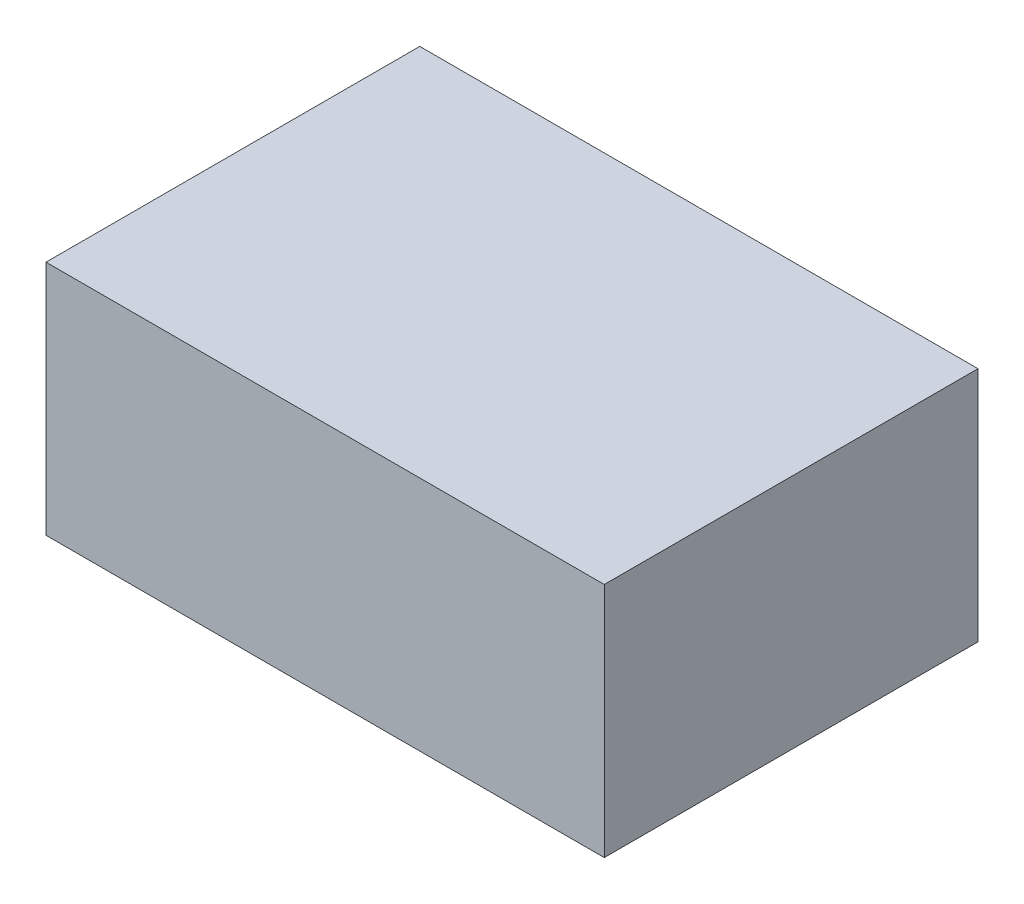
ISO-10303-21;
HEADER;
FILE_DESCRIPTION(('STEP AP214'),'2;1');
FILE_NAME('part.step','',(''),(''),'','','');
FILE_SCHEMA(('AUTOMOTIVE_DESIGN { 1 0 10303 214 1 1 1 1 }'));
ENDSEC;
DATA;
#1=APPLICATION_CONTEXT('core data for automotive mechanical design processes');
#2=APPLICATION_PROTOCOL_DEFINITION('international standard','automotive_design',2000,#1);
#3=PRODUCT_CONTEXT('',#1,'mechanical');
#4=PRODUCT('Part','Part','',(#3));
#5=PRODUCT_RELATED_PRODUCT_CATEGORY('part','',(#4));
#6=PRODUCT_DEFINITION_FORMATION('','',#4);
#7=PRODUCT_DEFINITION_CONTEXT('part definition',#1,'design');
#8=PRODUCT_DEFINITION('design','',#6,#7);
#9=PRODUCT_DEFINITION_SHAPE('','',#8);
#10=(LENGTH_UNIT() NAMED_UNIT(*) SI_UNIT(.MILLI.,.METRE.));
#11=(NAMED_UNIT(*) PLANE_ANGLE_UNIT() SI_UNIT($,.RADIAN.));
#12=(NAMED_UNIT(*) SI_UNIT($,.STERADIAN.) SOLID_ANGLE_UNIT());
#13=UNCERTAINTY_MEASURE_WITH_UNIT(LENGTH_MEASURE(1.E-05),#10,'distance_accuracy_value','');
#14=(GEOMETRIC_REPRESENTATION_CONTEXT(3) GLOBAL_UNCERTAINTY_ASSIGNED_CONTEXT((#13)) GLOBAL_UNIT_ASSIGNED_CONTEXT((#10,
#11,#12)) REPRESENTATION_CONTEXT('',''));
#15=CARTESIAN_POINT('',(0.,0.,0.));
#16=DIRECTION('',(0.,0.,1.));
#17=DIRECTION('',(1.,0.,0.));
#18=AXIS2_PLACEMENT_3D('',#15,#16,#17);
#19=CARTESIAN_POINT('',(1.4986,1.27,1.0033));
#20=DIRECTION('',(-1.,0.,0.));
#21=DIRECTION('',(0.,0.,1.));
#22=AXIS2_PLACEMENT_3D('',#19,#20,#21);
#23=PLANE('',#22);
#24=DIRECTION('',(0.,0.,-1.));
#25=VECTOR('',#24,1.);
#26=CARTESIAN_POINT('',(1.4986,0.,1.0033));
#27=LINE('',#26,#25);
#28=CARTESIAN_POINT('',(1.4986,0.,1.0033));
#29=VERTEX_POINT('',#28);
#30=CARTESIAN_POINT('',(1.4986,0.,-1.0033));
#31=VERTEX_POINT('',#30);
#32=EDGE_CURVE('E100',#29,#31,#27,.T.);
#33=ORIENTED_EDGE('',*,*,#32,.T.);
#34=DIRECTION('',(0.,-1.,0.));
#35=VECTOR('',#34,1.);
#36=CARTESIAN_POINT('',(1.4986,1.27,-1.0033));
#37=LINE('',#36,#35);
#38=CARTESIAN_POINT('',(1.4986,1.27,-1.0033));
#39=VERTEX_POINT('',#38);
#40=EDGE_CURVE('E11',#39,#31,#37,.T.);
#41=ORIENTED_EDGE('',*,*,#40,.F.);
#42=DIRECTION('',(0.,0.,-1.));
#43=VECTOR('',#42,1.);
#44=CARTESIAN_POINT('',(1.4986,1.27,1.0033));
#45=LINE('',#44,#43);
#46=CARTESIAN_POINT('',(1.4986,1.27,1.0033));
#47=VERTEX_POINT('',#46);
#48=EDGE_CURVE('E88',#47,#39,#45,.T.);
#49=ORIENTED_EDGE('',*,*,#48,.F.);
#50=DIRECTION('',(0.,-1.,0.));
#51=VECTOR('',#50,1.);
#52=CARTESIAN_POINT('',(1.4986,1.27,1.0033));
#53=LINE('',#52,#51);
#54=EDGE_CURVE('E96',#47,#29,#53,.T.);
#55=ORIENTED_EDGE('',*,*,#54,.T.);
#56=EDGE_LOOP('',(#33,#41,#49,#55));
#57=FACE_BOUND('',#56,.T.);
#58=ADVANCED_FACE('F37',(#57),#23,.F.);
#59=CARTESIAN_POINT('',(-1.4986,1.27,-1.0033));
#60=DIRECTION('',(0.,0.,1.));
#61=DIRECTION('',(1.,0.,0.));
#62=AXIS2_PLACEMENT_3D('',#59,#60,#61);
#63=PLANE('',#62);
#64=DIRECTION('',(-1.,0.,0.));
#65=VECTOR('',#64,1.);
#66=CARTESIAN_POINT('',(-1.4986,0.,-1.0033));
#67=LINE('',#66,#65);
#68=CARTESIAN_POINT('',(-1.4986,0.,-1.0033));
#69=VERTEX_POINT('',#68);
#70=EDGE_CURVE('E92',#31,#69,#67,.T.);
#71=ORIENTED_EDGE('',*,*,#70,.T.);
#72=DIRECTION('',(0.,-1.,0.));
#73=VECTOR('',#72,1.);
#74=CARTESIAN_POINT('',(-1.4986,1.27,-1.0033));
#75=LINE('',#74,#73);
#76=CARTESIAN_POINT('',(-1.4986,1.27,-1.0033));
#77=VERTEX_POINT('',#76);
#78=EDGE_CURVE('E45',#77,#69,#75,.T.);
#79=ORIENTED_EDGE('',*,*,#78,.F.);
#80=DIRECTION('',(-1.,0.,0.));
#81=VECTOR('',#80,1.);
#82=CARTESIAN_POINT('',(-1.4986,1.27,-1.0033));
#83=LINE('',#82,#81);
#84=EDGE_CURVE('E83',#39,#77,#83,.T.);
#85=ORIENTED_EDGE('',*,*,#84,.F.);
#86=ORIENTED_EDGE('',*,*,#40,.T.);
#87=EDGE_LOOP('',(#71,#79,#85,#86));
#88=FACE_BOUND('',#87,.T.);
#89=ADVANCED_FACE('F91',(#88),#63,.F.);
#90=CARTESIAN_POINT('',(-1.4986,1.27,1.0033));
#91=DIRECTION('',(1.,0.,0.));
#92=DIRECTION('',(0.,0.,-1.));
#93=AXIS2_PLACEMENT_3D('',#90,#91,#92);
#94=PLANE('',#93);
#95=DIRECTION('',(0.,0.,1.));
#96=VECTOR('',#95,1.);
#97=CARTESIAN_POINT('',(-1.4986,0.,1.0033));
#98=LINE('',#97,#96);
#99=CARTESIAN_POINT('',(-1.4986,0.,1.0033));
#100=VERTEX_POINT('',#99);
#101=EDGE_CURVE('E70',#69,#100,#98,.T.);
#102=ORIENTED_EDGE('',*,*,#101,.T.);
#103=DIRECTION('',(0.,-1.,0.));
#104=VECTOR('',#103,1.);
#105=CARTESIAN_POINT('',(-1.4986,1.27,1.0033));
#106=LINE('',#105,#104);
#107=CARTESIAN_POINT('',(-1.4986,1.27,1.0033));
#108=VERTEX_POINT('',#107);
#109=EDGE_CURVE('E93',#108,#100,#106,.T.);
#110=ORIENTED_EDGE('',*,*,#109,.F.);
#111=DIRECTION('',(0.,0.,1.));
#112=VECTOR('',#111,1.);
#113=CARTESIAN_POINT('',(-1.4986,1.27,1.0033));
#114=LINE('',#113,#112);
#115=EDGE_CURVE('E86',#77,#108,#114,.T.);
#116=ORIENTED_EDGE('',*,*,#115,.F.);
#117=ORIENTED_EDGE('',*,*,#78,.T.);
#118=EDGE_LOOP('',(#102,#110,#116,#117));
#119=FACE_BOUND('',#118,.T.);
#120=ADVANCED_FACE('F94',(#119),#94,.F.);
#121=CARTESIAN_POINT('',(-1.4986,1.27,1.0033));
#122=DIRECTION('',(0.,0.,-1.));
#123=DIRECTION('',(-1.,0.,0.));
#124=AXIS2_PLACEMENT_3D('',#121,#122,#123);
#125=PLANE('',#124);
#126=DIRECTION('',(1.,0.,0.));
#127=VECTOR('',#126,1.);
#128=CARTESIAN_POINT('',(-1.4986,0.,1.0033));
#129=LINE('',#128,#127);
#130=EDGE_CURVE('E76',#100,#29,#129,.T.);
#131=ORIENTED_EDGE('',*,*,#130,.T.);
#132=ORIENTED_EDGE('',*,*,#54,.F.);
#133=DIRECTION('',(1.,0.,0.));
#134=VECTOR('',#133,1.);
#135=CARTESIAN_POINT('',(-1.4986,1.27,1.0033));
#136=LINE('',#135,#134);
#137=EDGE_CURVE('E53',#108,#47,#136,.T.);
#138=ORIENTED_EDGE('',*,*,#137,.F.);
#139=ORIENTED_EDGE('',*,*,#109,.T.);
#140=EDGE_LOOP('',(#131,#132,#138,#139));
#141=FACE_BOUND('',#140,.T.);
#142=ADVANCED_FACE('F107',(#141),#125,.F.);
#143=CARTESIAN_POINT('',(0.,1.27,0.));
#144=DIRECTION('',(0.,-1.,0.));
#145=DIRECTION('',(0.,0.,-1.));
#146=AXIS2_PLACEMENT_3D('',#143,#144,#145);
#147=PLANE('',#146);
#148=ORIENTED_EDGE('',*,*,#48,.T.);
#149=ORIENTED_EDGE('',*,*,#84,.T.);
#150=ORIENTED_EDGE('',*,*,#115,.T.);
#151=ORIENTED_EDGE('',*,*,#137,.T.);
#152=EDGE_LOOP('',(#148,#149,#150,#151));
#153=FACE_BOUND('',#152,.T.);
#154=ADVANCED_FACE('F84',(#153),#147,.F.);
#155=CARTESIAN_POINT('',(0.,0.,0.));
#156=DIRECTION('',(0.,-1.,0.));
#157=DIRECTION('',(0.,0.,-1.));
#158=AXIS2_PLACEMENT_3D('',#155,#156,#157);
#159=PLANE('',#158);
#160=ORIENTED_EDGE('',*,*,#32,.F.);
#161=ORIENTED_EDGE('',*,*,#130,.F.);
#162=ORIENTED_EDGE('',*,*,#101,.F.);
#163=ORIENTED_EDGE('',*,*,#70,.F.);
#164=EDGE_LOOP('',(#160,#161,#162,#163));
#165=FACE_BOUND('',#164,.T.);
#166=ADVANCED_FACE('F110',(#165),#159,.T.);
#167=CLOSED_SHELL('',(#58,#89,#120,#142,#154,#166));
#168=MANIFOLD_SOLID_BREP('B2',#167);
#169=ADVANCED_BREP_SHAPE_REPRESENTATION('',(#18,#168),#14);
#170=SHAPE_DEFINITION_REPRESENTATION(#9,#169);
ENDSEC;
END-ISO-10303-21;
